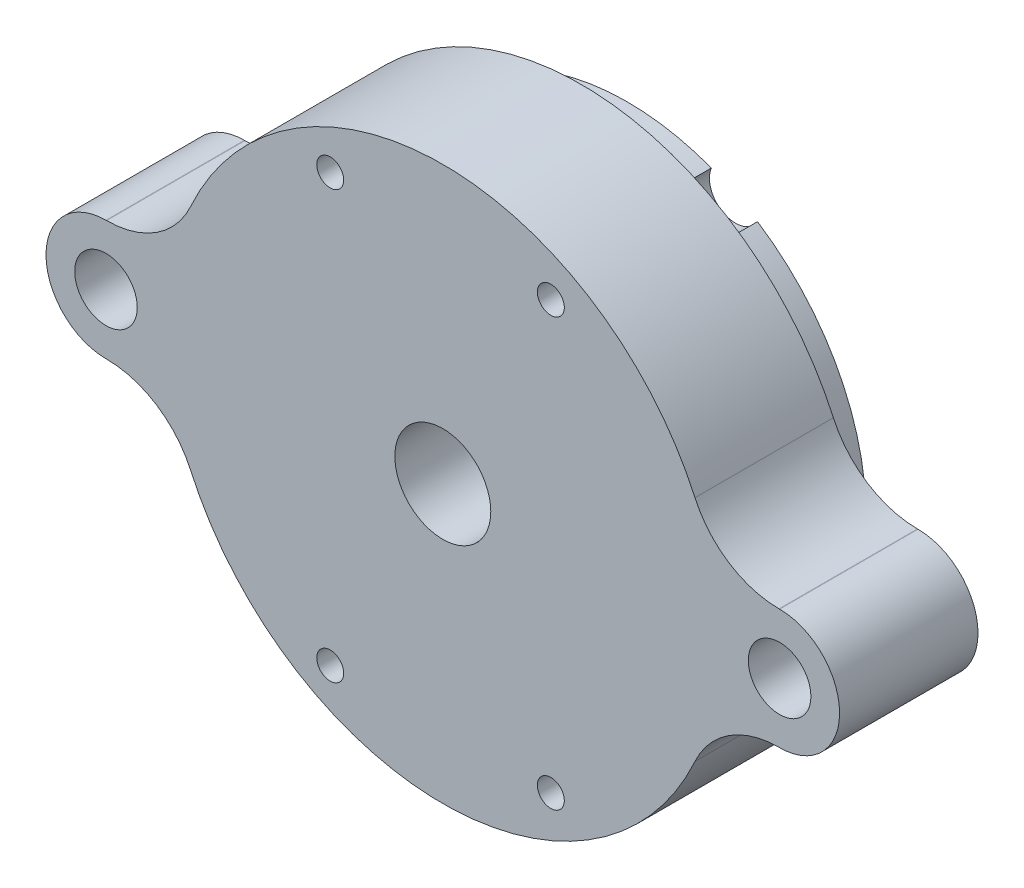
ISO-10303-21;
HEADER;
FILE_DESCRIPTION(('STEP AP214'),'2;1');
FILE_NAME('part.step','',(''),(''),'','','');
FILE_SCHEMA(('AUTOMOTIVE_DESIGN { 1 0 10303 214 1 1 1 1 }'));
ENDSEC;
DATA;
#1=APPLICATION_CONTEXT('core data for automotive mechanical design processes');
#2=APPLICATION_PROTOCOL_DEFINITION('international standard','automotive_design',2000,#1);
#3=PRODUCT_CONTEXT('',#1,'mechanical');
#4=PRODUCT('Part','Part','',(#3));
#5=PRODUCT_RELATED_PRODUCT_CATEGORY('part','',(#4));
#6=PRODUCT_DEFINITION_FORMATION('','',#4);
#7=PRODUCT_DEFINITION_CONTEXT('part definition',#1,'design');
#8=PRODUCT_DEFINITION('design','',#6,#7);
#9=PRODUCT_DEFINITION_SHAPE('','',#8);
#10=(LENGTH_UNIT() NAMED_UNIT(*) SI_UNIT(.MILLI.,.METRE.));
#11=(NAMED_UNIT(*) PLANE_ANGLE_UNIT() SI_UNIT($,.RADIAN.));
#12=(NAMED_UNIT(*) SI_UNIT($,.STERADIAN.) SOLID_ANGLE_UNIT());
#13=UNCERTAINTY_MEASURE_WITH_UNIT(LENGTH_MEASURE(1.E-05),#10,'distance_accuracy_value','');
#14=(GEOMETRIC_REPRESENTATION_CONTEXT(3) GLOBAL_UNCERTAINTY_ASSIGNED_CONTEXT((#13)) GLOBAL_UNIT_ASSIGNED_CONTEXT((#10,
#11,#12)) REPRESENTATION_CONTEXT('',''));
#15=CARTESIAN_POINT('',(0.,0.,0.));
#16=DIRECTION('',(0.,0.,1.));
#17=DIRECTION('',(1.,0.,0.));
#18=AXIS2_PLACEMENT_3D('',#15,#16,#17);
#19=CARTESIAN_POINT('',(0.,0.,6.35));
#20=DIRECTION('',(0.,0.,-1.));
#21=DIRECTION('',(-1.,0.,0.));
#22=AXIS2_PLACEMENT_3D('',#19,#20,#21);
#23=CYLINDRICAL_SURFACE('',#22,16.4211);
#24=CARTESIAN_POINT('',(0.,0.,0.));
#25=DIRECTION('',(0.,0.,1.));
#26=DIRECTION('',(1.,0.,0.));
#27=AXIS2_PLACEMENT_3D('',#24,#25,#26);
#28=CIRCLE('',#27,16.4211);
#29=CARTESIAN_POINT('',(8.95806742840503,-13.762469006619,0.));
#30=VERTEX_POINT('',#29);
#31=CARTESIAN_POINT('',(8.95806742840503,13.762469006619,0.));
#32=VERTEX_POINT('',#31);
#33=EDGE_CURVE('E208',#30,#32,#28,.T.);
#34=ORIENTED_EDGE('',*,*,#33,.T.);
#35=DIRECTION('',(0.,0.,-1.));
#36=VECTOR('',#35,1.);
#37=CARTESIAN_POINT('',(8.95806742840503,13.762469006619,3.175));
#38=LINE('',#37,#36);
#39=CARTESIAN_POINT('',(8.95806742840504,13.762469006619,3.175));
#40=VERTEX_POINT('',#39);
#41=EDGE_CURVE('E12',#32,#40,#38,.F.);
#42=ORIENTED_EDGE('',*,*,#41,.T.);
#43=CARTESIAN_POINT('',(0.,0.,3.175));
#44=DIRECTION('',(0.,0.,1.));
#45=DIRECTION('',(1.,0.,0.));
#46=AXIS2_PLACEMENT_3D('',#43,#44,#45);
#47=CIRCLE('',#46,16.4211);
#48=CARTESIAN_POINT('',(8.95806742840503,-13.762469006619,3.175));
#49=VERTEX_POINT('',#48);
#50=EDGE_CURVE('E224',#49,#40,#47,.T.);
#51=ORIENTED_EDGE('',*,*,#50,.F.);
#52=DIRECTION('',(0.,0.,-1.));
#53=VECTOR('',#52,1.);
#54=CARTESIAN_POINT('',(8.95806742840503,-13.762469006619,3.175));
#55=LINE('',#54,#53);
#56=EDGE_CURVE('E215',#49,#30,#55,.T.);
#57=ORIENTED_EDGE('',*,*,#56,.T.);
#58=EDGE_LOOP('',(#34,#42,#51,#57));
#59=FACE_BOUND('',#58,.T.);
#60=ADVANCED_FACE('F49',(#59),#23,.T.);
#61=CARTESIAN_POINT('',(0.,0.,0.));
#62=DIRECTION('',(0.,0.,1.));
#63=DIRECTION('',(1.,0.,0.));
#64=AXIS2_PLACEMENT_3D('',#61,#62,#63);
#65=PLANE('',#64);
#66=CARTESIAN_POINT('',(0.,0.,0.));
#67=DIRECTION('',(0.,0.,1.));
#68=DIRECTION('',(1.,0.,0.));
#69=AXIS2_PLACEMENT_3D('',#66,#67,#68);
#70=CIRCLE('',#69,3.302);
#71=CARTESIAN_POINT('',(3.302,0.,0.));
#72=VERTEX_POINT('',#71);
#73=EDGE_CURVE('E229',#72,#72,#70,.T.);
#74=ORIENTED_EDGE('',*,*,#73,.T.);
#75=EDGE_LOOP('',(#74));
#76=FACE_BOUND('',#75,.T.);
#77=CARTESIAN_POINT('',(5.78189663081512,15.3695216763753,0.));
#78=VERTEX_POINT('',#77);
#79=CARTESIAN_POINT('',(-6.0550197162745,15.2639857653736,0.));
#80=VERTEX_POINT('',#79);
#81=EDGE_CURVE('E210',#78,#80,#28,.T.);
#82=ORIENTED_EDGE('',*,*,#81,.F.);
#83=CARTESIAN_POINT('',(7.43504557778496,14.6945866102152,0.));
#84=DIRECTION('',(0.,0.,-1.));
#85=DIRECTION('',(-1.,0.,0.));
#86=AXIS2_PLACEMENT_3D('',#83,#84,#85);
#87=CIRCLE('',#86,1.78562);
#88=EDGE_CURVE('E67',#32,#78,#87,.T.);
#89=ORIENTED_EDGE('',*,*,#88,.F.);
#90=ORIENTED_EDGE('',*,*,#33,.F.);
#91=CARTESIAN_POINT('',(7.43504557778496,-14.6945866102152,0.));
#92=DIRECTION('',(0.,0.,-1.));
#93=DIRECTION('',(-1.,0.,0.));
#94=AXIS2_PLACEMENT_3D('',#91,#92,#93);
#95=CIRCLE('',#94,1.78562);
#96=CARTESIAN_POINT('',(5.78189663081512,-15.3695216763753,0.));
#97=VERTEX_POINT('',#96);
#98=EDGE_CURVE('E371',#97,#30,#95,.T.);
#99=ORIENTED_EDGE('',*,*,#98,.F.);
#100=CARTESIAN_POINT('',(-6.0550197162745,-15.2639857653736,0.));
#101=VERTEX_POINT('',#100);
#102=EDGE_CURVE('E219',#101,#97,#28,.T.);
#103=ORIENTED_EDGE('',*,*,#102,.F.);
#104=CARTESIAN_POINT('',(-7.74742137855946,-14.6945866102152,0.));
#105=DIRECTION('',(0.,0.,-1.));
#106=DIRECTION('',(-1.,0.,0.));
#107=AXIS2_PLACEMENT_3D('',#104,#105,#106);
#108=CIRCLE('',#107,1.78562);
#109=CARTESIAN_POINT('',(-9.17340917147283,-13.619878464316,0.));
#110=VERTEX_POINT('',#109);
#111=EDGE_CURVE('E386',#110,#101,#108,.T.);
#112=ORIENTED_EDGE('',*,*,#111,.F.);
#113=CARTESIAN_POINT('',(-9.17340917147283,13.619878464316,0.));
#114=VERTEX_POINT('',#113);
#115=EDGE_CURVE('E226',#114,#110,#28,.T.);
#116=ORIENTED_EDGE('',*,*,#115,.F.);
#117=CARTESIAN_POINT('',(-7.74742137855946,14.6945866102152,0.));
#118=DIRECTION('',(0.,0.,-1.));
#119=DIRECTION('',(-1.,0.,0.));
#120=AXIS2_PLACEMENT_3D('',#117,#118,#119);
#121=CIRCLE('',#120,1.78562);
#122=EDGE_CURVE('E402',#80,#114,#121,.T.);
#123=ORIENTED_EDGE('',*,*,#122,.F.);
#124=EDGE_LOOP('',(#82,#89,#90,#99,#103,#112,#116,#123));
#125=FACE_BOUND('',#124,.T.);
#126=ADVANCED_FACE('F206',(#76,#125),#65,.F.);
#127=CARTESIAN_POINT('',(5.78189663081512,15.3695216763753,3.175));
#128=VERTEX_POINT('',#127);
#129=CARTESIAN_POINT('',(-6.05501971627449,15.2639857653736,3.175));
#130=VERTEX_POINT('',#129);
#131=EDGE_CURVE('E471',#128,#130,#47,.T.);
#132=ORIENTED_EDGE('',*,*,#131,.F.);
#133=DIRECTION('',(0.,0.,-1.));
#134=VECTOR('',#133,1.);
#135=CARTESIAN_POINT('',(5.78189663081512,15.3695216763753,3.175));
#136=LINE('',#135,#134);
#137=EDGE_CURVE('E58',#128,#78,#136,.T.);
#138=ORIENTED_EDGE('',*,*,#137,.T.);
#139=ORIENTED_EDGE('',*,*,#81,.T.);
#140=DIRECTION('',(0.,0.,-1.));
#141=VECTOR('',#140,1.);
#142=CARTESIAN_POINT('',(-6.0550197162745,15.2639857653736,3.175));
#143=LINE('',#142,#141);
#144=EDGE_CURVE('E389',#80,#130,#143,.F.);
#145=ORIENTED_EDGE('',*,*,#144,.T.);
#146=EDGE_LOOP('',(#132,#138,#139,#145));
#147=FACE_BOUND('',#146,.T.);
#148=ADVANCED_FACE('F435',(#147),#23,.T.);
#149=CARTESIAN_POINT('',(-9.17340917147284,13.619878464316,3.175));
#150=VERTEX_POINT('',#149);
#151=CARTESIAN_POINT('',(-9.17340917147284,-13.619878464316,3.175));
#152=VERTEX_POINT('',#151);
#153=EDGE_CURVE('E222',#150,#152,#47,.T.);
#154=ORIENTED_EDGE('',*,*,#153,.F.);
#155=DIRECTION('',(0.,0.,-1.));
#156=VECTOR('',#155,1.);
#157=CARTESIAN_POINT('',(-9.17340917147283,13.619878464316,3.175));
#158=LINE('',#157,#156);
#159=EDGE_CURVE('E75',#150,#114,#158,.T.);
#160=ORIENTED_EDGE('',*,*,#159,.T.);
#161=ORIENTED_EDGE('',*,*,#115,.T.);
#162=DIRECTION('',(0.,0.,-1.));
#163=VECTOR('',#162,1.);
#164=CARTESIAN_POINT('',(-9.17340917147283,-13.619878464316,3.175));
#165=LINE('',#164,#163);
#166=EDGE_CURVE('E467',#110,#152,#165,.F.);
#167=ORIENTED_EDGE('',*,*,#166,.T.);
#168=EDGE_LOOP('',(#154,#160,#161,#167));
#169=FACE_BOUND('',#168,.T.);
#170=ADVANCED_FACE('F443',(#169),#23,.T.);
#171=CARTESIAN_POINT('',(23.1775,0.,3.175));
#172=DIRECTION('',(0.,0.,1.));
#173=DIRECTION('',(1.,0.,0.));
#174=AXIS2_PLACEMENT_3D('',#171,#172,#173);
#175=PLANE('',#174);
#176=CARTESIAN_POINT('',(23.1775,0.,3.175));
#177=DIRECTION('',(0.,0.,-1.));
#178=DIRECTION('',(-1.,0.,0.));
#179=AXIS2_PLACEMENT_3D('',#176,#177,#178);
#180=CIRCLE('',#179,2.65430000000001);
#181=CARTESIAN_POINT('',(20.5232,0.,3.175));
#182=VERTEX_POINT('',#181);
#183=EDGE_CURVE('E349',#182,#182,#180,.T.);
#184=ORIENTED_EDGE('',*,*,#183,.F.);
#185=EDGE_LOOP('',(#184));
#186=FACE_BOUND('',#185,.T.);
#187=CARTESIAN_POINT('',(-23.1775,0.,3.175));
#188=DIRECTION('',(0.,0.,-1.));
#189=DIRECTION('',(-1.,0.,0.));
#190=AXIS2_PLACEMENT_3D('',#187,#188,#189);
#191=CIRCLE('',#190,2.65430000000001);
#192=CARTESIAN_POINT('',(-25.8318,0.,3.175));
#193=VERTEX_POINT('',#192);
#194=EDGE_CURVE('E342',#193,#193,#191,.T.);
#195=ORIENTED_EDGE('',*,*,#194,.F.);
#196=EDGE_LOOP('',(#195));
#197=FACE_BOUND('',#196,.T.);
#198=ORIENTED_EDGE('',*,*,#50,.T.);
#199=CARTESIAN_POINT('',(7.43504557778496,14.6945866102152,3.175));
#200=DIRECTION('',(0.,0.,1.));
#201=DIRECTION('',(1.,0.,0.));
#202=AXIS2_PLACEMENT_3D('',#199,#200,#201);
#203=CIRCLE('',#202,1.78562);
#204=EDGE_CURVE('E198',#40,#128,#203,.T.);
#205=ORIENTED_EDGE('',*,*,#204,.T.);
#206=ORIENTED_EDGE('',*,*,#131,.T.);
#207=CARTESIAN_POINT('',(-7.74742137855946,14.6945866102152,3.175));
#208=DIRECTION('',(0.,0.,1.));
#209=DIRECTION('',(1.,0.,0.));
#210=AXIS2_PLACEMENT_3D('',#207,#208,#209);
#211=CIRCLE('',#210,1.78562);
#212=EDGE_CURVE('E487',#130,#150,#211,.T.);
#213=ORIENTED_EDGE('',*,*,#212,.T.);
#214=ORIENTED_EDGE('',*,*,#153,.T.);
#215=CARTESIAN_POINT('',(-7.74742137855946,-14.6945866102152,3.175));
#216=DIRECTION('',(0.,0.,1.));
#217=DIRECTION('',(1.,0.,0.));
#218=AXIS2_PLACEMENT_3D('',#215,#216,#217);
#219=CIRCLE('',#218,1.78562);
#220=CARTESIAN_POINT('',(-6.0550197162745,-15.2639857653736,3.175));
#221=VERTEX_POINT('',#220);
#222=EDGE_CURVE('E373',#152,#221,#219,.T.);
#223=ORIENTED_EDGE('',*,*,#222,.T.);
#224=CARTESIAN_POINT('',(5.78189663081511,-15.3695216763753,3.175));
#225=VERTEX_POINT('',#224);
#226=EDGE_CURVE('E217',#221,#225,#47,.T.);
#227=ORIENTED_EDGE('',*,*,#226,.T.);
#228=CARTESIAN_POINT('',(7.43504557778496,-14.6945866102152,3.175));
#229=DIRECTION('',(0.,0.,1.));
#230=DIRECTION('',(1.,0.,0.));
#231=AXIS2_PLACEMENT_3D('',#228,#229,#230);
#232=CIRCLE('',#231,1.78562);
#233=EDGE_CURVE('E356',#225,#49,#232,.T.);
#234=ORIENTED_EDGE('',*,*,#233,.T.);
#235=EDGE_LOOP('',(#198,#205,#206,#213,#214,#223,#227,#234));
#236=FACE_BOUND('',#235,.T.);
#237=CARTESIAN_POINT('',(23.1775,0.,3.175));
#238=DIRECTION('',(0.,0.,1.));
#239=DIRECTION('',(1.,0.,0.));
#240=AXIS2_PLACEMENT_3D('',#237,#238,#239);
#241=CIRCLE('',#240,4.1275);
#242=CARTESIAN_POINT('',(23.1775,-4.1275,3.175));
#243=VERTEX_POINT('',#242);
#244=CARTESIAN_POINT('',(23.1775,4.1275,3.175));
#245=VERTEX_POINT('',#244);
#246=EDGE_CURVE('E329',#243,#245,#241,.T.);
#247=ORIENTED_EDGE('',*,*,#246,.F.);
#248=DIRECTION('',(1.,0.,0.));
#249=VECTOR('',#248,1.);
#250=CARTESIAN_POINT('',(23.1383230539726,-4.1275,3.175));
#251=LINE('',#250,#249);
#252=CARTESIAN_POINT('',(23.1383230539726,-4.1275,3.175));
#253=VERTEX_POINT('',#252);
#254=EDGE_CURVE('E294',#253,#243,#251,.T.);
#255=ORIENTED_EDGE('',*,*,#254,.F.);
#256=CARTESIAN_POINT('',(23.1383230539726,-10.4775,3.175));
#257=DIRECTION('',(0.,0.,-1.));
#258=DIRECTION('',(1.,0.,0.));
#259=AXIS2_PLACEMENT_3D('',#256,#257,#258);
#260=CIRCLE('',#259,6.35);
#261=CARTESIAN_POINT('',(17.3537422904795,-7.85812500000001,3.175));
#262=VERTEX_POINT('',#261);
#263=EDGE_CURVE('E297',#262,#253,#260,.T.);
#264=ORIENTED_EDGE('',*,*,#263,.F.);
#265=CARTESIAN_POINT('',(0.,0.,3.175));
#266=DIRECTION('',(0.,0.,1.));
#267=DIRECTION('',(1.,0.,0.));
#268=AXIS2_PLACEMENT_3D('',#265,#266,#267);
#269=CIRCLE('',#268,19.05);
#270=CARTESIAN_POINT('',(-17.3537422904795,-7.858125,3.175));
#271=VERTEX_POINT('',#270);
#272=EDGE_CURVE('E300',#271,#262,#269,.T.);
#273=ORIENTED_EDGE('',*,*,#272,.F.);
#274=CARTESIAN_POINT('',(-23.1383230539726,-10.4775,3.175));
#275=DIRECTION('',(0.,0.,-1.));
#276=DIRECTION('',(1.,0.,0.));
#277=AXIS2_PLACEMENT_3D('',#274,#275,#276);
#278=CIRCLE('',#277,6.35);
#279=CARTESIAN_POINT('',(-23.1383230539726,-4.1275,3.175));
#280=VERTEX_POINT('',#279);
#281=EDGE_CURVE('E304',#280,#271,#278,.T.);
#282=ORIENTED_EDGE('',*,*,#281,.F.);
#283=DIRECTION('',(1.,0.,0.));
#284=VECTOR('',#283,1.);
#285=CARTESIAN_POINT('',(-23.1775,-4.1275,3.175));
#286=LINE('',#285,#284);
#287=CARTESIAN_POINT('',(-23.1775,-4.1275,3.175));
#288=VERTEX_POINT('',#287);
#289=EDGE_CURVE('E307',#288,#280,#286,.T.);
#290=ORIENTED_EDGE('',*,*,#289,.F.);
#291=CARTESIAN_POINT('',(-23.1775,0.,3.175));
#292=DIRECTION('',(0.,0.,1.));
#293=DIRECTION('',(1.,0.,0.));
#294=AXIS2_PLACEMENT_3D('',#291,#292,#293);
#295=CIRCLE('',#294,4.1275);
#296=CARTESIAN_POINT('',(-23.1775,4.1275,3.175));
#297=VERTEX_POINT('',#296);
#298=EDGE_CURVE('E310',#297,#288,#295,.T.);
#299=ORIENTED_EDGE('',*,*,#298,.F.);
#300=DIRECTION('',(-1.,0.,0.));
#301=VECTOR('',#300,1.);
#302=CARTESIAN_POINT('',(-23.1383230539726,4.1275,3.175));
#303=LINE('',#302,#301);
#304=CARTESIAN_POINT('',(-23.1383230539726,4.1275,3.175));
#305=VERTEX_POINT('',#304);
#306=EDGE_CURVE('E313',#305,#297,#303,.T.);
#307=ORIENTED_EDGE('',*,*,#306,.F.);
#308=CARTESIAN_POINT('',(-23.1383230539726,10.4775,3.175));
#309=DIRECTION('',(0.,0.,-1.));
#310=DIRECTION('',(1.,0.,0.));
#311=AXIS2_PLACEMENT_3D('',#308,#309,#310);
#312=CIRCLE('',#311,6.35);
#313=CARTESIAN_POINT('',(-17.3537422904795,7.858125,3.175));
#314=VERTEX_POINT('',#313);
#315=EDGE_CURVE('E316',#314,#305,#312,.T.);
#316=ORIENTED_EDGE('',*,*,#315,.F.);
#317=CARTESIAN_POINT('',(0.,0.,3.175));
#318=DIRECTION('',(0.,0.,1.));
#319=DIRECTION('',(1.,0.,0.));
#320=AXIS2_PLACEMENT_3D('',#317,#318,#319);
#321=CIRCLE('',#320,19.05);
#322=CARTESIAN_POINT('',(17.3537422904795,7.858125,3.175));
#323=VERTEX_POINT('',#322);
#324=EDGE_CURVE('E319',#323,#314,#321,.T.);
#325=ORIENTED_EDGE('',*,*,#324,.F.);
#326=CARTESIAN_POINT('',(23.1383230539726,10.4775,3.175));
#327=DIRECTION('',(0.,0.,-1.));
#328=DIRECTION('',(1.,0.,0.));
#329=AXIS2_PLACEMENT_3D('',#326,#327,#328);
#330=CIRCLE('',#329,6.35);
#331=CARTESIAN_POINT('',(23.1383230539726,4.1275,3.175));
#332=VERTEX_POINT('',#331);
#333=EDGE_CURVE('E323',#332,#323,#330,.T.);
#334=ORIENTED_EDGE('',*,*,#333,.F.);
#335=DIRECTION('',(-1.,0.,0.));
#336=VECTOR('',#335,1.);
#337=CARTESIAN_POINT('',(23.1775,4.1275,3.175));
#338=LINE('',#337,#336);
#339=EDGE_CURVE('E326',#245,#332,#338,.T.);
#340=ORIENTED_EDGE('',*,*,#339,.F.);
#341=EDGE_LOOP('',(#247,#255,#264,#273,#282,#290,#299,#307,#316,#325,#334,#340));
#342=FACE_BOUND('',#341,.T.);
#343=ADVANCED_FACE('F446',(#186,#197,#236,#342),#175,.F.);
#344=ORIENTED_EDGE('',*,*,#226,.F.);
#345=DIRECTION('',(0.,0.,-1.));
#346=VECTOR('',#345,1.);
#347=CARTESIAN_POINT('',(-6.0550197162745,-15.2639857653736,3.175));
#348=LINE('',#347,#346);
#349=EDGE_CURVE('E483',#221,#101,#348,.T.);
#350=ORIENTED_EDGE('',*,*,#349,.T.);
#351=ORIENTED_EDGE('',*,*,#102,.T.);
#352=DIRECTION('',(0.,0.,-1.));
#353=VECTOR('',#352,1.);
#354=CARTESIAN_POINT('',(5.78189663081512,-15.3695216763753,3.175));
#355=LINE('',#354,#353);
#356=EDGE_CURVE('E481',#97,#225,#355,.F.);
#357=ORIENTED_EDGE('',*,*,#356,.T.);
#358=EDGE_LOOP('',(#344,#350,#351,#357));
#359=FACE_BOUND('',#358,.T.);
#360=ADVANCED_FACE('F436',(#359),#23,.T.);
#361=CARTESIAN_POINT('',(0.,0.,6.35));
#362=DIRECTION('',(0.,0.,-1.));
#363=DIRECTION('',(-1.,0.,0.));
#364=AXIS2_PLACEMENT_3D('',#361,#362,#363);
#365=CYLINDRICAL_SURFACE('',#364,3.302);
#366=ORIENTED_EDGE('',*,*,#73,.F.);
#367=EDGE_LOOP('',(#366));
#368=FACE_BOUND('',#367,.T.);
#369=CARTESIAN_POINT('',(0.,0.,12.7));
#370=DIRECTION('',(0.,0.,1.));
#371=DIRECTION('',(1.,0.,0.));
#372=AXIS2_PLACEMENT_3D('',#369,#370,#371);
#373=CIRCLE('',#372,3.302);
#374=CARTESIAN_POINT('',(3.302,0.,12.7));
#375=VERTEX_POINT('',#374);
#376=EDGE_CURVE('E352',#375,#375,#373,.T.);
#377=ORIENTED_EDGE('',*,*,#376,.T.);
#378=EDGE_LOOP('',(#377));
#379=FACE_BOUND('',#378,.T.);
#380=ADVANCED_FACE('F51',(#368,#379),#365,.F.);
#381=CARTESIAN_POINT('',(23.1775,0.,12.7));
#382=DIRECTION('',(0.,0.,1.));
#383=DIRECTION('',(1.,0.,0.));
#384=AXIS2_PLACEMENT_3D('',#381,#382,#383);
#385=PLANE('',#384);
#386=CARTESIAN_POINT('',(7.43504557778496,14.6945866102152,12.7));
#387=DIRECTION('',(0.,0.,-1.));
#388=DIRECTION('',(-1.,0.,0.));
#389=AXIS2_PLACEMENT_3D('',#386,#387,#388);
#390=CIRCLE('',#389,0.927100000000008);
#391=CARTESIAN_POINT('',(6.50794557778495,14.6945866102152,12.7));
#392=VERTEX_POINT('',#391);
#393=EDGE_CURVE('E406',#392,#392,#390,.T.);
#394=ORIENTED_EDGE('',*,*,#393,.T.);
#395=EDGE_LOOP('',(#394));
#396=FACE_BOUND('',#395,.T.);
#397=CARTESIAN_POINT('',(-7.74742137855946,14.6945866102152,12.7));
#398=DIRECTION('',(0.,0.,-1.));
#399=DIRECTION('',(-1.,0.,0.));
#400=AXIS2_PLACEMENT_3D('',#397,#398,#399);
#401=CIRCLE('',#400,0.927100000000008);
#402=CARTESIAN_POINT('',(-8.67452137855947,14.6945866102152,12.7));
#403=VERTEX_POINT('',#402);
#404=EDGE_CURVE('E393',#403,#403,#401,.T.);
#405=ORIENTED_EDGE('',*,*,#404,.T.);
#406=EDGE_LOOP('',(#405));
#407=FACE_BOUND('',#406,.T.);
#408=CARTESIAN_POINT('',(-7.74742137855946,-14.6945866102152,12.7));
#409=DIRECTION('',(0.,0.,-1.));
#410=DIRECTION('',(-1.,0.,0.));
#411=AXIS2_PLACEMENT_3D('',#408,#409,#410);
#412=CIRCLE('',#411,0.927100000000008);
#413=CARTESIAN_POINT('',(-8.67452137855947,-14.6945866102152,12.7));
#414=VERTEX_POINT('',#413);
#415=EDGE_CURVE('E377',#414,#414,#412,.T.);
#416=ORIENTED_EDGE('',*,*,#415,.T.);
#417=EDGE_LOOP('',(#416));
#418=FACE_BOUND('',#417,.T.);
#419=CARTESIAN_POINT('',(7.43504557778496,-14.6945866102152,12.7));
#420=DIRECTION('',(0.,0.,-1.));
#421=DIRECTION('',(-1.,0.,0.));
#422=AXIS2_PLACEMENT_3D('',#419,#420,#421);
#423=CIRCLE('',#422,0.927100000000007);
#424=CARTESIAN_POINT('',(6.50794557778495,-14.6945866102152,12.7));
#425=VERTEX_POINT('',#424);
#426=EDGE_CURVE('E360',#425,#425,#423,.T.);
#427=ORIENTED_EDGE('',*,*,#426,.T.);
#428=EDGE_LOOP('',(#427));
#429=FACE_BOUND('',#428,.T.);
#430=CARTESIAN_POINT('',(23.1775,0.,12.7));
#431=DIRECTION('',(0.,0.,1.));
#432=DIRECTION('',(1.,0.,0.));
#433=AXIS2_PLACEMENT_3D('',#430,#431,#432);
#434=CIRCLE('',#433,2.15264999999999);
#435=CARTESIAN_POINT('',(25.33015,0.,12.7));
#436=VERTEX_POINT('',#435);
#437=EDGE_CURVE('E335',#436,#436,#434,.T.);
#438=ORIENTED_EDGE('',*,*,#437,.F.);
#439=EDGE_LOOP('',(#438));
#440=FACE_BOUND('',#439,.T.);
#441=CARTESIAN_POINT('',(-23.1775,0.,12.7));
#442=DIRECTION('',(0.,0.,1.));
#443=DIRECTION('',(1.,0.,0.));
#444=AXIS2_PLACEMENT_3D('',#441,#442,#443);
#445=CIRCLE('',#444,2.15264999999999);
#446=CARTESIAN_POINT('',(-21.02485,0.,12.7));
#447=VERTEX_POINT('',#446);
#448=EDGE_CURVE('E332',#447,#447,#445,.T.);
#449=ORIENTED_EDGE('',*,*,#448,.F.);
#450=EDGE_LOOP('',(#449));
#451=FACE_BOUND('',#450,.T.);
#452=CARTESIAN_POINT('',(23.1775,0.,12.7));
#453=DIRECTION('',(0.,0.,1.));
#454=DIRECTION('',(1.,0.,0.));
#455=AXIS2_PLACEMENT_3D('',#452,#453,#454);
#456=CIRCLE('',#455,4.1275);
#457=CARTESIAN_POINT('',(23.1775,-4.1275,12.7));
#458=VERTEX_POINT('',#457);
#459=CARTESIAN_POINT('',(23.1775,4.1275,12.7));
#460=VERTEX_POINT('',#459);
#461=EDGE_CURVE('E291',#458,#460,#456,.T.);
#462=ORIENTED_EDGE('',*,*,#461,.T.);
#463=DIRECTION('',(-1.,0.,0.));
#464=VECTOR('',#463,1.);
#465=CARTESIAN_POINT('',(23.1775,4.1275,12.7));
#466=LINE('',#465,#464);
#467=CARTESIAN_POINT('',(23.1383230539726,4.1275,12.7));
#468=VERTEX_POINT('',#467);
#469=EDGE_CURVE('E289',#460,#468,#466,.T.);
#470=ORIENTED_EDGE('',*,*,#469,.T.);
#471=CARTESIAN_POINT('',(23.1383230539726,10.4775,12.7));
#472=DIRECTION('',(0.,0.,-1.));
#473=DIRECTION('',(1.,0.,0.));
#474=AXIS2_PLACEMENT_3D('',#471,#472,#473);
#475=CIRCLE('',#474,6.35);
#476=CARTESIAN_POINT('',(17.3537422904795,7.858125,12.7));
#477=VERTEX_POINT('',#476);
#478=EDGE_CURVE('E287',#468,#477,#475,.T.);
#479=ORIENTED_EDGE('',*,*,#478,.T.);
#480=CARTESIAN_POINT('',(0.,0.,12.7));
#481=DIRECTION('',(0.,0.,1.));
#482=DIRECTION('',(1.,0.,0.));
#483=AXIS2_PLACEMENT_3D('',#480,#481,#482);
#484=CIRCLE('',#483,19.05);
#485=CARTESIAN_POINT('',(-17.3537422904795,7.858125,12.7));
#486=VERTEX_POINT('',#485);
#487=EDGE_CURVE('E284',#477,#486,#484,.T.);
#488=ORIENTED_EDGE('',*,*,#487,.T.);
#489=CARTESIAN_POINT('',(-23.1383230539726,10.4775,12.7));
#490=DIRECTION('',(0.,0.,-1.));
#491=DIRECTION('',(1.,0.,0.));
#492=AXIS2_PLACEMENT_3D('',#489,#490,#491);
#493=CIRCLE('',#492,6.35);
#494=CARTESIAN_POINT('',(-23.1383230539726,4.1275,12.7));
#495=VERTEX_POINT('',#494);
#496=EDGE_CURVE('E281',#486,#495,#493,.T.);
#497=ORIENTED_EDGE('',*,*,#496,.T.);
#498=DIRECTION('',(-1.,0.,0.));
#499=VECTOR('',#498,1.);
#500=CARTESIAN_POINT('',(-23.1383230539726,4.1275,12.7));
#501=LINE('',#500,#499);
#502=CARTESIAN_POINT('',(-23.1775,4.1275,12.7));
#503=VERTEX_POINT('',#502);
#504=EDGE_CURVE('E279',#495,#503,#501,.T.);
#505=ORIENTED_EDGE('',*,*,#504,.T.);
#506=CARTESIAN_POINT('',(-23.1775,0.,12.7));
#507=DIRECTION('',(0.,0.,1.));
#508=DIRECTION('',(1.,0.,0.));
#509=AXIS2_PLACEMENT_3D('',#506,#507,#508);
#510=CIRCLE('',#509,4.1275);
#511=CARTESIAN_POINT('',(-23.1775,-4.1275,12.7));
#512=VERTEX_POINT('',#511);
#513=EDGE_CURVE('E277',#503,#512,#510,.T.);
#514=ORIENTED_EDGE('',*,*,#513,.T.);
#515=DIRECTION('',(1.,0.,0.));
#516=VECTOR('',#515,1.);
#517=CARTESIAN_POINT('',(-23.1775,-4.1275,12.7));
#518=LINE('',#517,#516);
#519=CARTESIAN_POINT('',(-23.1383230539726,-4.1275,12.7));
#520=VERTEX_POINT('',#519);
#521=EDGE_CURVE('E275',#512,#520,#518,.T.);
#522=ORIENTED_EDGE('',*,*,#521,.T.);
#523=CARTESIAN_POINT('',(-23.1383230539726,-10.4775,12.7));
#524=DIRECTION('',(0.,0.,-1.));
#525=DIRECTION('',(1.,0.,0.));
#526=AXIS2_PLACEMENT_3D('',#523,#524,#525);
#527=CIRCLE('',#526,6.35);
#528=CARTESIAN_POINT('',(-17.3537422904795,-7.858125,12.7));
#529=VERTEX_POINT('',#528);
#530=EDGE_CURVE('E273',#520,#529,#527,.T.);
#531=ORIENTED_EDGE('',*,*,#530,.T.);
#532=CARTESIAN_POINT('',(0.,0.,12.7));
#533=DIRECTION('',(0.,0.,1.));
#534=DIRECTION('',(1.,0.,0.));
#535=AXIS2_PLACEMENT_3D('',#532,#533,#534);
#536=CIRCLE('',#535,19.05);
#537=CARTESIAN_POINT('',(17.3537422904795,-7.85812500000001,12.7));
#538=VERTEX_POINT('',#537);
#539=EDGE_CURVE('E270',#529,#538,#536,.T.);
#540=ORIENTED_EDGE('',*,*,#539,.T.);
#541=CARTESIAN_POINT('',(23.1383230539726,-10.4775,12.7));
#542=DIRECTION('',(0.,0.,-1.));
#543=DIRECTION('',(1.,0.,0.));
#544=AXIS2_PLACEMENT_3D('',#541,#542,#543);
#545=CIRCLE('',#544,6.35);
#546=CARTESIAN_POINT('',(23.1383230539726,-4.1275,12.7));
#547=VERTEX_POINT('',#546);
#548=EDGE_CURVE('E268',#538,#547,#545,.T.);
#549=ORIENTED_EDGE('',*,*,#548,.T.);
#550=DIRECTION('',(1.,0.,0.));
#551=VECTOR('',#550,1.);
#552=CARTESIAN_POINT('',(23.1383230539726,-4.1275,12.7));
#553=LINE('',#552,#551);
#554=EDGE_CURVE('E266',#547,#458,#553,.T.);
#555=ORIENTED_EDGE('',*,*,#554,.T.);
#556=EDGE_LOOP('',(#462,#470,#479,#488,#497,#505,#514,#522,#531,#540,#549,#555));
#557=FACE_BOUND('',#556,.T.);
#558=ORIENTED_EDGE('',*,*,#376,.F.);
#559=EDGE_LOOP('',(#558));
#560=FACE_BOUND('',#559,.T.);
#561=ADVANCED_FACE('F452',(#396,#407,#418,#429,#440,#451,#557,#560),#385,.T.);
#562=CARTESIAN_POINT('',(23.1775,0.,12.7));
#563=DIRECTION('',(0.,0.,-1.));
#564=DIRECTION('',(-1.,0.,0.));
#565=AXIS2_PLACEMENT_3D('',#562,#563,#564);
#566=CYLINDRICAL_SURFACE('',#565,4.1275);
#567=DIRECTION('',(0.,0.,-1.));
#568=VECTOR('',#567,1.);
#569=CARTESIAN_POINT('',(23.1775,-4.1275,12.7));
#570=LINE('',#569,#568);
#571=EDGE_CURVE('E264',#458,#243,#570,.T.);
#572=ORIENTED_EDGE('',*,*,#571,.T.);
#573=ORIENTED_EDGE('',*,*,#246,.T.);
#574=DIRECTION('',(0.,0.,-1.));
#575=VECTOR('',#574,1.);
#576=CARTESIAN_POINT('',(23.1775,4.1275,12.7));
#577=LINE('',#576,#575);
#578=EDGE_CURVE('E238',#460,#245,#577,.T.);
#579=ORIENTED_EDGE('',*,*,#578,.F.);
#580=ORIENTED_EDGE('',*,*,#461,.F.);
#581=EDGE_LOOP('',(#572,#573,#579,#580));
#582=FACE_BOUND('',#581,.T.);
#583=ADVANCED_FACE('F552',(#582),#566,.T.);
#584=CARTESIAN_POINT('',(23.1775,4.1275,12.7));
#585=DIRECTION('',(0.,-1.,0.));
#586=DIRECTION('',(0.,0.,-1.));
#587=AXIS2_PLACEMENT_3D('',#584,#585,#586);
#588=PLANE('',#587);
#589=ORIENTED_EDGE('',*,*,#578,.T.);
#590=ORIENTED_EDGE('',*,*,#339,.T.);
#591=DIRECTION('',(0.,0.,-1.));
#592=VECTOR('',#591,1.);
#593=CARTESIAN_POINT('',(23.1383230539726,4.1275,12.7));
#594=LINE('',#593,#592);
#595=EDGE_CURVE('E241',#468,#332,#594,.T.);
#596=ORIENTED_EDGE('',*,*,#595,.F.);
#597=ORIENTED_EDGE('',*,*,#469,.F.);
#598=EDGE_LOOP('',(#589,#590,#596,#597));
#599=FACE_BOUND('',#598,.T.);
#600=ADVANCED_FACE('F592',(#599),#588,.F.);
#601=CARTESIAN_POINT('',(23.1383230539726,10.4775,12.7));
#602=DIRECTION('',(0.,0.,-1.));
#603=DIRECTION('',(-1.,0.,0.));
#604=AXIS2_PLACEMENT_3D('',#601,#602,#603);
#605=CYLINDRICAL_SURFACE('',#604,6.35);
#606=ORIENTED_EDGE('',*,*,#595,.T.);
#607=ORIENTED_EDGE('',*,*,#333,.T.);
#608=DIRECTION('',(0.,0.,-1.));
#609=VECTOR('',#608,1.);
#610=CARTESIAN_POINT('',(17.3537422904795,7.858125,12.7));
#611=LINE('',#610,#609);
#612=EDGE_CURVE('E245',#477,#323,#611,.T.);
#613=ORIENTED_EDGE('',*,*,#612,.F.);
#614=ORIENTED_EDGE('',*,*,#478,.F.);
#615=EDGE_LOOP('',(#606,#607,#613,#614));
#616=FACE_BOUND('',#615,.T.);
#617=ADVANCED_FACE('F588',(#616),#605,.F.);
#618=CARTESIAN_POINT('',(0.,0.,12.7));
#619=DIRECTION('',(0.,0.,-1.));
#620=DIRECTION('',(-1.,0.,0.));
#621=AXIS2_PLACEMENT_3D('',#618,#619,#620);
#622=CYLINDRICAL_SURFACE('',#621,19.05);
#623=ORIENTED_EDGE('',*,*,#612,.T.);
#624=ORIENTED_EDGE('',*,*,#324,.T.);
#625=DIRECTION('',(0.,0.,-1.));
#626=VECTOR('',#625,1.);
#627=CARTESIAN_POINT('',(-17.3537422904795,7.858125,12.7));
#628=LINE('',#627,#626);
#629=EDGE_CURVE('E247',#486,#314,#628,.T.);
#630=ORIENTED_EDGE('',*,*,#629,.F.);
#631=ORIENTED_EDGE('',*,*,#487,.F.);
#632=EDGE_LOOP('',(#623,#624,#630,#631));
#633=FACE_BOUND('',#632,.T.);
#634=ADVANCED_FACE('F584',(#633),#622,.T.);
#635=CARTESIAN_POINT('',(-23.1383230539726,10.4775,12.7));
#636=DIRECTION('',(0.,0.,-1.));
#637=DIRECTION('',(-1.,0.,0.));
#638=AXIS2_PLACEMENT_3D('',#635,#636,#637);
#639=CYLINDRICAL_SURFACE('',#638,6.35);
#640=ORIENTED_EDGE('',*,*,#629,.T.);
#641=ORIENTED_EDGE('',*,*,#315,.T.);
#642=DIRECTION('',(0.,0.,-1.));
#643=VECTOR('',#642,1.);
#644=CARTESIAN_POINT('',(-23.1383230539726,4.1275,12.7));
#645=LINE('',#644,#643);
#646=EDGE_CURVE('E250',#495,#305,#645,.T.);
#647=ORIENTED_EDGE('',*,*,#646,.F.);
#648=ORIENTED_EDGE('',*,*,#496,.F.);
#649=EDGE_LOOP('',(#640,#641,#647,#648));
#650=FACE_BOUND('',#649,.T.);
#651=ADVANCED_FACE('F580',(#650),#639,.F.);
#652=CARTESIAN_POINT('',(-23.1383230539726,4.1275,12.7));
#653=DIRECTION('',(0.,-1.,0.));
#654=DIRECTION('',(1.,0.,0.));
#655=AXIS2_PLACEMENT_3D('',#652,#653,#654);
#656=PLANE('',#655);
#657=ORIENTED_EDGE('',*,*,#646,.T.);
#658=ORIENTED_EDGE('',*,*,#306,.T.);
#659=DIRECTION('',(0.,0.,-1.));
#660=VECTOR('',#659,1.);
#661=CARTESIAN_POINT('',(-23.1775,4.1275,12.7));
#662=LINE('',#661,#660);
#663=EDGE_CURVE('E252',#503,#297,#662,.T.);
#664=ORIENTED_EDGE('',*,*,#663,.F.);
#665=ORIENTED_EDGE('',*,*,#504,.F.);
#666=EDGE_LOOP('',(#657,#658,#664,#665));
#667=FACE_BOUND('',#666,.T.);
#668=ADVANCED_FACE('F576',(#667),#656,.F.);
#669=CARTESIAN_POINT('',(-23.1775,0.,12.7));
#670=DIRECTION('',(0.,0.,-1.));
#671=DIRECTION('',(-1.,0.,0.));
#672=AXIS2_PLACEMENT_3D('',#669,#670,#671);
#673=CYLINDRICAL_SURFACE('',#672,4.1275);
#674=ORIENTED_EDGE('',*,*,#663,.T.);
#675=ORIENTED_EDGE('',*,*,#298,.T.);
#676=DIRECTION('',(0.,0.,-1.));
#677=VECTOR('',#676,1.);
#678=CARTESIAN_POINT('',(-23.1775,-4.1275,12.7));
#679=LINE('',#678,#677);
#680=EDGE_CURVE('E254',#512,#288,#679,.T.);
#681=ORIENTED_EDGE('',*,*,#680,.F.);
#682=ORIENTED_EDGE('',*,*,#513,.F.);
#683=EDGE_LOOP('',(#674,#675,#681,#682));
#684=FACE_BOUND('',#683,.T.);
#685=ADVANCED_FACE('F572',(#684),#673,.T.);
#686=CARTESIAN_POINT('',(-23.1775,-4.1275,12.7));
#687=DIRECTION('',(0.,1.,0.));
#688=DIRECTION('',(0.,0.,1.));
#689=AXIS2_PLACEMENT_3D('',#686,#687,#688);
#690=PLANE('',#689);
#691=ORIENTED_EDGE('',*,*,#680,.T.);
#692=ORIENTED_EDGE('',*,*,#289,.T.);
#693=DIRECTION('',(0.,0.,-1.));
#694=VECTOR('',#693,1.);
#695=CARTESIAN_POINT('',(-23.1383230539726,-4.1275,12.7));
#696=LINE('',#695,#694);
#697=EDGE_CURVE('E256',#520,#280,#696,.T.);
#698=ORIENTED_EDGE('',*,*,#697,.F.);
#699=ORIENTED_EDGE('',*,*,#521,.F.);
#700=EDGE_LOOP('',(#691,#692,#698,#699));
#701=FACE_BOUND('',#700,.T.);
#702=ADVANCED_FACE('F568',(#701),#690,.F.);
#703=CARTESIAN_POINT('',(-23.1383230539726,-10.4775,12.7));
#704=DIRECTION('',(0.,0.,-1.));
#705=DIRECTION('',(-1.,0.,0.));
#706=AXIS2_PLACEMENT_3D('',#703,#704,#705);
#707=CYLINDRICAL_SURFACE('',#706,6.35);
#708=ORIENTED_EDGE('',*,*,#697,.T.);
#709=ORIENTED_EDGE('',*,*,#281,.T.);
#710=DIRECTION('',(0.,0.,-1.));
#711=VECTOR('',#710,1.);
#712=CARTESIAN_POINT('',(-17.3537422904795,-7.858125,12.7));
#713=LINE('',#712,#711);
#714=EDGE_CURVE('E258',#529,#271,#713,.T.);
#715=ORIENTED_EDGE('',*,*,#714,.F.);
#716=ORIENTED_EDGE('',*,*,#530,.F.);
#717=EDGE_LOOP('',(#708,#709,#715,#716));
#718=FACE_BOUND('',#717,.T.);
#719=ADVANCED_FACE('F564',(#718),#707,.F.);
#720=CARTESIAN_POINT('',(0.,0.,12.7));
#721=DIRECTION('',(0.,0.,-1.));
#722=DIRECTION('',(-1.,0.,0.));
#723=AXIS2_PLACEMENT_3D('',#720,#721,#722);
#724=CYLINDRICAL_SURFACE('',#723,19.05);
#725=ORIENTED_EDGE('',*,*,#714,.T.);
#726=ORIENTED_EDGE('',*,*,#272,.T.);
#727=DIRECTION('',(0.,0.,-1.));
#728=VECTOR('',#727,1.);
#729=CARTESIAN_POINT('',(17.3537422904795,-7.85812500000001,12.7));
#730=LINE('',#729,#728);
#731=EDGE_CURVE('E260',#538,#262,#730,.T.);
#732=ORIENTED_EDGE('',*,*,#731,.F.);
#733=ORIENTED_EDGE('',*,*,#539,.F.);
#734=EDGE_LOOP('',(#725,#726,#732,#733));
#735=FACE_BOUND('',#734,.T.);
#736=ADVANCED_FACE('F560',(#735),#724,.T.);
#737=CARTESIAN_POINT('',(23.1383230539726,-10.4775,12.7));
#738=DIRECTION('',(0.,0.,-1.));
#739=DIRECTION('',(-1.,0.,0.));
#740=AXIS2_PLACEMENT_3D('',#737,#738,#739);
#741=CYLINDRICAL_SURFACE('',#740,6.35);
#742=ORIENTED_EDGE('',*,*,#731,.T.);
#743=ORIENTED_EDGE('',*,*,#263,.T.);
#744=DIRECTION('',(0.,0.,-1.));
#745=VECTOR('',#744,1.);
#746=CARTESIAN_POINT('',(23.1383230539726,-4.1275,12.7));
#747=LINE('',#746,#745);
#748=EDGE_CURVE('E262',#547,#253,#747,.T.);
#749=ORIENTED_EDGE('',*,*,#748,.F.);
#750=ORIENTED_EDGE('',*,*,#548,.F.);
#751=EDGE_LOOP('',(#742,#743,#749,#750));
#752=FACE_BOUND('',#751,.T.);
#753=ADVANCED_FACE('F556',(#752),#741,.F.);
#754=CARTESIAN_POINT('',(23.1383230539726,-4.1275,12.7));
#755=DIRECTION('',(0.,1.,0.));
#756=DIRECTION('',(-1.,0.,0.));
#757=AXIS2_PLACEMENT_3D('',#754,#755,#756);
#758=PLANE('',#757);
#759=ORIENTED_EDGE('',*,*,#748,.T.);
#760=ORIENTED_EDGE('',*,*,#254,.T.);
#761=ORIENTED_EDGE('',*,*,#571,.F.);
#762=ORIENTED_EDGE('',*,*,#554,.F.);
#763=EDGE_LOOP('',(#759,#760,#761,#762));
#764=FACE_BOUND('',#763,.T.);
#765=ADVANCED_FACE('F547',(#764),#758,.F.);
#766=CARTESIAN_POINT('',(-23.1775,0.,3.175));
#767=DIRECTION('',(0.,0.,-1.));
#768=DIRECTION('',(-1.,0.,0.));
#769=AXIS2_PLACEMENT_3D('',#766,#767,#768);
#770=CYLINDRICAL_SURFACE('',#769,2.15264999999999);
#771=CARTESIAN_POINT('',(-23.1775,0.,6.98499999999999));
#772=DIRECTION('',(0.,0.,1.));
#773=DIRECTION('',(1.,0.,0.));
#774=AXIS2_PLACEMENT_3D('',#771,#772,#773);
#775=CIRCLE('',#774,2.15264999999999);
#776=CARTESIAN_POINT('',(-21.02485,0.,6.98499999999999));
#777=VERTEX_POINT('',#776);
#778=EDGE_CURVE('E338',#777,#777,#775,.F.);
#779=ORIENTED_EDGE('',*,*,#778,.T.);
#780=EDGE_LOOP('',(#779));
#781=FACE_BOUND('',#780,.T.);
#782=ORIENTED_EDGE('',*,*,#448,.T.);
#783=EDGE_LOOP('',(#782));
#784=FACE_BOUND('',#783,.T.);
#785=ADVANCED_FACE('F544',(#781,#784),#770,.F.);
#786=CARTESIAN_POINT('',(23.1775,0.,3.175));
#787=DIRECTION('',(0.,0.,-1.));
#788=DIRECTION('',(-1.,0.,0.));
#789=AXIS2_PLACEMENT_3D('',#786,#787,#788);
#790=CYLINDRICAL_SURFACE('',#789,2.15264999999999);
#791=CARTESIAN_POINT('',(23.1775,0.,6.98499999999999));
#792=DIRECTION('',(0.,0.,1.));
#793=DIRECTION('',(1.,0.,0.));
#794=AXIS2_PLACEMENT_3D('',#791,#792,#793);
#795=CIRCLE('',#794,2.15264999999999);
#796=CARTESIAN_POINT('',(25.33015,0.,6.98499999999999));
#797=VERTEX_POINT('',#796);
#798=EDGE_CURVE('E345',#797,#797,#795,.F.);
#799=ORIENTED_EDGE('',*,*,#798,.T.);
#800=EDGE_LOOP('',(#799));
#801=FACE_BOUND('',#800,.T.);
#802=ORIENTED_EDGE('',*,*,#437,.T.);
#803=EDGE_LOOP('',(#802));
#804=FACE_BOUND('',#803,.T.);
#805=ADVANCED_FACE('F540',(#801,#804),#790,.F.);
#806=CARTESIAN_POINT('',(-23.1775,0.,6.98499999999999));
#807=DIRECTION('',(0.,0.,1.));
#808=DIRECTION('',(1.,0.,0.));
#809=AXIS2_PLACEMENT_3D('',#806,#807,#808);
#810=PLANE('',#809);
#811=CARTESIAN_POINT('',(-23.1775,0.,6.98499999999999));
#812=DIRECTION('',(0.,0.,-1.));
#813=DIRECTION('',(-1.,0.,0.));
#814=AXIS2_PLACEMENT_3D('',#811,#812,#813);
#815=CIRCLE('',#814,2.52730000000001);
#816=CARTESIAN_POINT('',(-25.7048,0.,6.98499999999999));
#817=VERTEX_POINT('',#816);
#818=EDGE_CURVE('E339',#817,#817,#815,.T.);
#819=ORIENTED_EDGE('',*,*,#818,.T.);
#820=EDGE_LOOP('',(#819));
#821=FACE_BOUND('',#820,.T.);
#822=ORIENTED_EDGE('',*,*,#778,.F.);
#823=EDGE_LOOP('',(#822));
#824=FACE_BOUND('',#823,.T.);
#825=ADVANCED_FACE('F536',(#821,#824),#810,.F.);
#826=CARTESIAN_POINT('',(-23.1775,0.,3.175));
#827=DIRECTION('',(0.,0.,-1.));
#828=DIRECTION('',(-1.,0.,0.));
#829=AXIS2_PLACEMENT_3D('',#826,#827,#828);
#830=CONICAL_SURFACE('',#829,2.65430000000001,0.0333209958782469);
#831=ORIENTED_EDGE('',*,*,#818,.F.);
#832=EDGE_LOOP('',(#831));
#833=FACE_BOUND('',#832,.T.);
#834=ORIENTED_EDGE('',*,*,#194,.T.);
#835=EDGE_LOOP('',(#834));
#836=FACE_BOUND('',#835,.T.);
#837=ADVANCED_FACE('F532',(#833,#836),#830,.F.);
#838=CARTESIAN_POINT('',(23.1775,0.,6.98499999999999));
#839=DIRECTION('',(0.,0.,1.));
#840=DIRECTION('',(1.,0.,0.));
#841=AXIS2_PLACEMENT_3D('',#838,#839,#840);
#842=PLANE('',#841);
#843=CARTESIAN_POINT('',(23.1775,0.,6.98499999999999));
#844=DIRECTION('',(0.,0.,-1.));
#845=DIRECTION('',(-1.,0.,0.));
#846=AXIS2_PLACEMENT_3D('',#843,#844,#845);
#847=CIRCLE('',#846,2.52730000000001);
#848=CARTESIAN_POINT('',(20.6502,0.,6.98499999999999));
#849=VERTEX_POINT('',#848);
#850=EDGE_CURVE('E346',#849,#849,#847,.T.);
#851=ORIENTED_EDGE('',*,*,#850,.T.);
#852=EDGE_LOOP('',(#851));
#853=FACE_BOUND('',#852,.T.);
#854=ORIENTED_EDGE('',*,*,#798,.F.);
#855=EDGE_LOOP('',(#854));
#856=FACE_BOUND('',#855,.T.);
#857=ADVANCED_FACE('F528',(#853,#856),#842,.F.);
#858=CARTESIAN_POINT('',(23.1775,0.,3.175));
#859=DIRECTION('',(0.,0.,-1.));
#860=DIRECTION('',(-1.,0.,0.));
#861=AXIS2_PLACEMENT_3D('',#858,#859,#860);
#862=CONICAL_SURFACE('',#861,2.65430000000001,0.0333209958782469);
#863=ORIENTED_EDGE('',*,*,#850,.F.);
#864=EDGE_LOOP('',(#863));
#865=FACE_BOUND('',#864,.T.);
#866=ORIENTED_EDGE('',*,*,#183,.T.);
#867=EDGE_LOOP('',(#866));
#868=FACE_BOUND('',#867,.T.);
#869=ADVANCED_FACE('F520',(#865,#868),#862,.F.);
#870=CARTESIAN_POINT('',(7.43504557778496,-14.6945866102152,0.));
#871=DIRECTION('',(0.,0.,-1.));
#872=DIRECTION('',(-1.,0.,0.));
#873=AXIS2_PLACEMENT_3D('',#870,#871,#872);
#874=CYLINDRICAL_SURFACE('',#873,1.78562);
#875=CARTESIAN_POINT('',(7.43504557778496,-14.6945866102152,6.35));
#876=DIRECTION('',(0.,0.,-1.));
#877=DIRECTION('',(-1.,0.,0.));
#878=AXIS2_PLACEMENT_3D('',#875,#876,#877);
#879=CIRCLE('',#878,1.78562);
#880=CARTESIAN_POINT('',(5.64942557778496,-14.6945866102152,6.35));
#881=VERTEX_POINT('',#880);
#882=EDGE_CURVE('E367',#881,#881,#879,.T.);
#883=ORIENTED_EDGE('',*,*,#882,.F.);
#884=EDGE_LOOP('',(#883));
#885=FACE_BOUND('',#884,.T.);
#886=ORIENTED_EDGE('',*,*,#98,.T.);
#887=ORIENTED_EDGE('',*,*,#56,.F.);
#888=ORIENTED_EDGE('',*,*,#233,.F.);
#889=ORIENTED_EDGE('',*,*,#356,.F.);
#890=EDGE_LOOP('',(#886,#887,#888,#889));
#891=FACE_BOUND('',#890,.T.);
#892=ADVANCED_FACE('F494',(#885,#891),#874,.F.);
#893=CARTESIAN_POINT('',(7.43504557778496,-14.6945866102152,0.));
#894=DIRECTION('',(0.,0.,-1.));
#895=DIRECTION('',(-1.,0.,0.));
#896=AXIS2_PLACEMENT_3D('',#893,#894,#895);
#897=CYLINDRICAL_SURFACE('',#896,0.927100000000003);
#898=ORIENTED_EDGE('',*,*,#426,.F.);
#899=EDGE_LOOP('',(#898));
#900=FACE_BOUND('',#899,.T.);
#901=CARTESIAN_POINT('',(7.43504557778496,-14.6945866102152,6.35));
#902=DIRECTION('',(0.,0.,-1.));
#903=DIRECTION('',(-1.,0.,0.));
#904=AXIS2_PLACEMENT_3D('',#901,#902,#903);
#905=CIRCLE('',#904,0.927099999999998);
#906=CARTESIAN_POINT('',(6.50794557778496,-14.6945866102152,6.35));
#907=VERTEX_POINT('',#906);
#908=EDGE_CURVE('E364',#907,#907,#905,.T.);
#909=ORIENTED_EDGE('',*,*,#908,.T.);
#910=EDGE_LOOP('',(#909));
#911=FACE_BOUND('',#910,.T.);
#912=ADVANCED_FACE('F509',(#900,#911),#897,.F.);
#913=CARTESIAN_POINT('',(8.36214557778496,-14.6945866102152,6.35));
#914=DIRECTION('',(0.,0.,1.));
#915=DIRECTION('',(1.,0.,0.));
#916=AXIS2_PLACEMENT_3D('',#913,#914,#915);
#917=PLANE('',#916);
#918=ORIENTED_EDGE('',*,*,#908,.F.);
#919=EDGE_LOOP('',(#918));
#920=FACE_BOUND('',#919,.T.);
#921=ORIENTED_EDGE('',*,*,#882,.T.);
#922=EDGE_LOOP('',(#921));
#923=FACE_BOUND('',#922,.T.);
#924=ADVANCED_FACE('F500',(#920,#923),#917,.F.);
#925=CARTESIAN_POINT('',(-7.74742137855946,-14.6945866102152,0.));
#926=DIRECTION('',(0.,0.,-1.));
#927=DIRECTION('',(-1.,0.,0.));
#928=AXIS2_PLACEMENT_3D('',#925,#926,#927);
#929=CYLINDRICAL_SURFACE('',#928,1.78562);
#930=CARTESIAN_POINT('',(-7.74742137855946,-14.6945866102152,6.35));
#931=DIRECTION('',(0.,0.,-1.));
#932=DIRECTION('',(-1.,0.,0.));
#933=AXIS2_PLACEMENT_3D('',#930,#931,#932);
#934=CIRCLE('',#933,1.78562);
#935=CARTESIAN_POINT('',(-9.53304137855946,-14.6945866102152,6.35));
#936=VERTEX_POINT('',#935);
#937=EDGE_CURVE('E383',#936,#936,#934,.T.);
#938=ORIENTED_EDGE('',*,*,#937,.F.);
#939=EDGE_LOOP('',(#938));
#940=FACE_BOUND('',#939,.T.);
#941=ORIENTED_EDGE('',*,*,#111,.T.);
#942=ORIENTED_EDGE('',*,*,#349,.F.);
#943=ORIENTED_EDGE('',*,*,#222,.F.);
#944=ORIENTED_EDGE('',*,*,#166,.F.);
#945=EDGE_LOOP('',(#941,#942,#943,#944));
#946=FACE_BOUND('',#945,.T.);
#947=ADVANCED_FACE('F497',(#940,#946),#929,.F.);
#948=CARTESIAN_POINT('',(-7.74742137855946,-14.6945866102152,0.));
#949=DIRECTION('',(0.,0.,-1.));
#950=DIRECTION('',(-1.,0.,0.));
#951=AXIS2_PLACEMENT_3D('',#948,#949,#950);
#952=CYLINDRICAL_SURFACE('',#951,0.927100000000004);
#953=ORIENTED_EDGE('',*,*,#415,.F.);
#954=EDGE_LOOP('',(#953));
#955=FACE_BOUND('',#954,.T.);
#956=CARTESIAN_POINT('',(-7.74742137855946,-14.6945866102152,6.35));
#957=DIRECTION('',(0.,0.,-1.));
#958=DIRECTION('',(-1.,0.,0.));
#959=AXIS2_PLACEMENT_3D('',#956,#957,#958);
#960=CIRCLE('',#959,0.927099999999999);
#961=CARTESIAN_POINT('',(-8.67452137855946,-14.6945866102152,6.35));
#962=VERTEX_POINT('',#961);
#963=EDGE_CURVE('E380',#962,#962,#960,.T.);
#964=ORIENTED_EDGE('',*,*,#963,.T.);
#965=EDGE_LOOP('',(#964));
#966=FACE_BOUND('',#965,.T.);
#967=ADVANCED_FACE('F499',(#955,#966),#952,.F.);
#968=CARTESIAN_POINT('',(-6.82032137855946,-14.6945866102152,6.35));
#969=DIRECTION('',(0.,0.,1.));
#970=DIRECTION('',(1.,0.,0.));
#971=AXIS2_PLACEMENT_3D('',#968,#969,#970);
#972=PLANE('',#971);
#973=ORIENTED_EDGE('',*,*,#963,.F.);
#974=EDGE_LOOP('',(#973));
#975=FACE_BOUND('',#974,.T.);
#976=ORIENTED_EDGE('',*,*,#937,.T.);
#977=EDGE_LOOP('',(#976));
#978=FACE_BOUND('',#977,.T.);
#979=ADVANCED_FACE('F506',(#975,#978),#972,.F.);
#980=CARTESIAN_POINT('',(-7.74742137855946,14.6945866102152,0.));
#981=DIRECTION('',(0.,0.,-1.));
#982=DIRECTION('',(-1.,0.,0.));
#983=AXIS2_PLACEMENT_3D('',#980,#981,#982);
#984=CYLINDRICAL_SURFACE('',#983,1.78562);
#985=CARTESIAN_POINT('',(-7.74742137855946,14.6945866102152,6.35));
#986=DIRECTION('',(0.,0.,-1.));
#987=DIRECTION('',(-1.,0.,0.));
#988=AXIS2_PLACEMENT_3D('',#985,#986,#987);
#989=CIRCLE('',#988,1.78562);
#990=CARTESIAN_POINT('',(-9.53304137855946,14.6945866102152,6.35));
#991=VERTEX_POINT('',#990);
#992=EDGE_CURVE('E399',#991,#991,#989,.T.);
#993=ORIENTED_EDGE('',*,*,#992,.F.);
#994=EDGE_LOOP('',(#993));
#995=FACE_BOUND('',#994,.T.);
#996=ORIENTED_EDGE('',*,*,#122,.T.);
#997=ORIENTED_EDGE('',*,*,#159,.F.);
#998=ORIENTED_EDGE('',*,*,#212,.F.);
#999=ORIENTED_EDGE('',*,*,#144,.F.);
#1000=EDGE_LOOP('',(#996,#997,#998,#999));
#1001=FACE_BOUND('',#1000,.T.);
#1002=ADVANCED_FACE('F516',(#995,#1001),#984,.F.);
#1003=CARTESIAN_POINT('',(-7.74742137855946,14.6945866102152,0.));
#1004=DIRECTION('',(0.,0.,-1.));
#1005=DIRECTION('',(-1.,0.,0.));
#1006=AXIS2_PLACEMENT_3D('',#1003,#1004,#1005);
#1007=CYLINDRICAL_SURFACE('',#1006,0.927100000000004);
#1008=ORIENTED_EDGE('',*,*,#404,.F.);
#1009=EDGE_LOOP('',(#1008));
#1010=FACE_BOUND('',#1009,.T.);
#1011=CARTESIAN_POINT('',(-7.74742137855946,14.6945866102152,6.35));
#1012=DIRECTION('',(0.,0.,-1.));
#1013=DIRECTION('',(-1.,0.,0.));
#1014=AXIS2_PLACEMENT_3D('',#1011,#1012,#1013);
#1015=CIRCLE('',#1014,0.927099999999999);
#1016=CARTESIAN_POINT('',(-8.67452137855946,14.6945866102152,6.35));
#1017=VERTEX_POINT('',#1016);
#1018=EDGE_CURVE('E396',#1017,#1017,#1015,.T.);
#1019=ORIENTED_EDGE('',*,*,#1018,.T.);
#1020=EDGE_LOOP('',(#1019));
#1021=FACE_BOUND('',#1020,.T.);
#1022=ADVANCED_FACE('F430',(#1010,#1021),#1007,.F.);
#1023=CARTESIAN_POINT('',(-6.82032137855946,14.6945866102152,6.35));
#1024=DIRECTION('',(0.,0.,1.));
#1025=DIRECTION('',(1.,0.,0.));
#1026=AXIS2_PLACEMENT_3D('',#1023,#1024,#1025);
#1027=PLANE('',#1026);
#1028=ORIENTED_EDGE('',*,*,#1018,.F.);
#1029=EDGE_LOOP('',(#1028));
#1030=FACE_BOUND('',#1029,.T.);
#1031=ORIENTED_EDGE('',*,*,#992,.T.);
#1032=EDGE_LOOP('',(#1031));
#1033=FACE_BOUND('',#1032,.T.);
#1034=ADVANCED_FACE('F422',(#1030,#1033),#1027,.F.);
#1035=CARTESIAN_POINT('',(7.43504557778496,14.6945866102152,0.));
#1036=DIRECTION('',(0.,0.,-1.));
#1037=DIRECTION('',(-1.,0.,0.));
#1038=AXIS2_PLACEMENT_3D('',#1035,#1036,#1037);
#1039=CYLINDRICAL_SURFACE('',#1038,1.78562);
#1040=CARTESIAN_POINT('',(7.43504557778496,14.6945866102152,6.35));
#1041=DIRECTION('',(0.,0.,-1.));
#1042=DIRECTION('',(-1.,0.,0.));
#1043=AXIS2_PLACEMENT_3D('',#1040,#1041,#1042);
#1044=CIRCLE('',#1043,1.78562);
#1045=CARTESIAN_POINT('',(5.64942557778496,14.6945866102152,6.35));
#1046=VERTEX_POINT('',#1045);
#1047=EDGE_CURVE('E212',#1046,#1046,#1044,.T.);
#1048=ORIENTED_EDGE('',*,*,#1047,.F.);
#1049=EDGE_LOOP('',(#1048));
#1050=FACE_BOUND('',#1049,.T.);
#1051=ORIENTED_EDGE('',*,*,#88,.T.);
#1052=ORIENTED_EDGE('',*,*,#137,.F.);
#1053=ORIENTED_EDGE('',*,*,#204,.F.);
#1054=ORIENTED_EDGE('',*,*,#41,.F.);
#1055=EDGE_LOOP('',(#1051,#1052,#1053,#1054));
#1056=FACE_BOUND('',#1055,.T.);
#1057=ADVANCED_FACE('F196',(#1050,#1056),#1039,.F.);
#1058=CARTESIAN_POINT('',(7.43504557778496,14.6945866102152,0.));
#1059=DIRECTION('',(0.,0.,-1.));
#1060=DIRECTION('',(-1.,0.,0.));
#1061=AXIS2_PLACEMENT_3D('',#1058,#1059,#1060);
#1062=CYLINDRICAL_SURFACE('',#1061,0.927100000000004);
#1063=ORIENTED_EDGE('',*,*,#393,.F.);
#1064=EDGE_LOOP('',(#1063));
#1065=FACE_BOUND('',#1064,.T.);
#1066=CARTESIAN_POINT('',(7.43504557778496,14.6945866102152,6.35));
#1067=DIRECTION('',(0.,0.,-1.));
#1068=DIRECTION('',(-1.,0.,0.));
#1069=AXIS2_PLACEMENT_3D('',#1066,#1067,#1068);
#1070=CIRCLE('',#1069,0.927099999999999);
#1071=CARTESIAN_POINT('',(6.50794557778496,14.6945866102152,6.35));
#1072=VERTEX_POINT('',#1071);
#1073=EDGE_CURVE('E410',#1072,#1072,#1070,.T.);
#1074=ORIENTED_EDGE('',*,*,#1073,.T.);
#1075=EDGE_LOOP('',(#1074));
#1076=FACE_BOUND('',#1075,.T.);
#1077=ADVANCED_FACE('F421',(#1065,#1076),#1062,.F.);
#1078=CARTESIAN_POINT('',(8.36214557778496,14.6945866102152,6.35));
#1079=DIRECTION('',(0.,0.,1.));
#1080=DIRECTION('',(1.,0.,0.));
#1081=AXIS2_PLACEMENT_3D('',#1078,#1079,#1080);
#1082=PLANE('',#1081);
#1083=ORIENTED_EDGE('',*,*,#1073,.F.);
#1084=EDGE_LOOP('',(#1083));
#1085=FACE_BOUND('',#1084,.T.);
#1086=ORIENTED_EDGE('',*,*,#1047,.T.);
#1087=EDGE_LOOP('',(#1086));
#1088=FACE_BOUND('',#1087,.T.);
#1089=ADVANCED_FACE('F418',(#1085,#1088),#1082,.F.);
#1090=CLOSED_SHELL('',(#60,#126,#148,#170,#343,#360,#380,#561,#583,#600,#617,#634,#651,#668,
#685,#702,#719,#736,#753,#765,#785,#805,#825,#837,#857,#869,#892,#912,#924,#947,#967,#979,#1002,
#1022,#1034,#1057,#1077,#1089));
#1091=MANIFOLD_SOLID_BREP('B2',#1090);
#1092=ADVANCED_BREP_SHAPE_REPRESENTATION('',(#18,#1091),#14);
#1093=SHAPE_DEFINITION_REPRESENTATION(#9,#1092);
ENDSEC;
END-ISO-10303-21;
